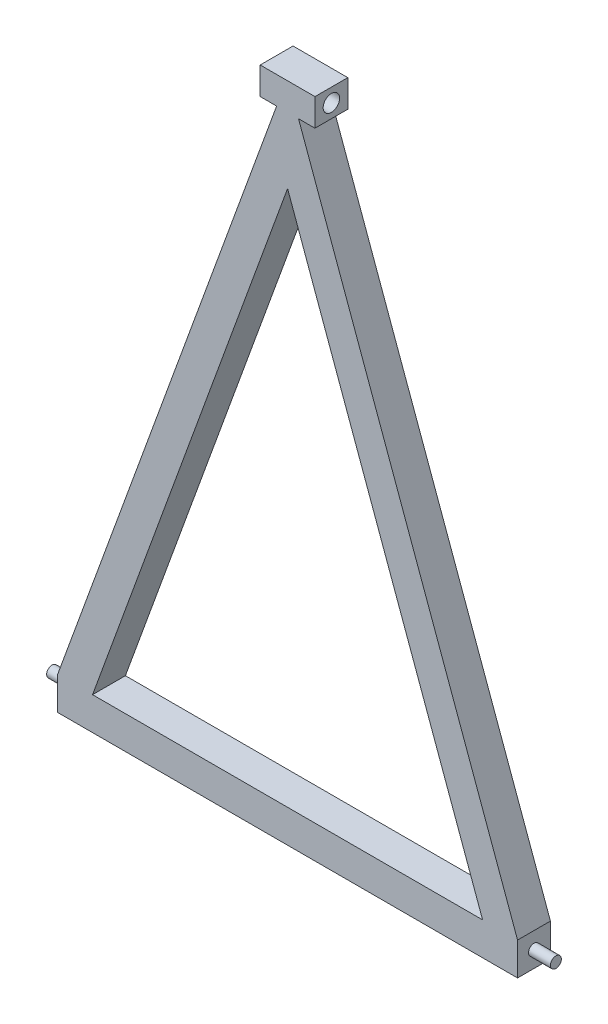
ISO-10303-21;
HEADER;
FILE_DESCRIPTION(('STEP AP214'),'2;1');
FILE_NAME('part.step','',(''),(''),'','','');
FILE_SCHEMA(('AUTOMOTIVE_DESIGN { 1 0 10303 214 1 1 1 1 }'));
ENDSEC;
DATA;
#1=APPLICATION_CONTEXT('core data for automotive mechanical design processes');
#2=APPLICATION_PROTOCOL_DEFINITION('international standard','automotive_design',2000,#1);
#3=PRODUCT_CONTEXT('',#1,'mechanical');
#4=PRODUCT('Part','Part','',(#3));
#5=PRODUCT_RELATED_PRODUCT_CATEGORY('part','',(#4));
#6=PRODUCT_DEFINITION_FORMATION('','',#4);
#7=PRODUCT_DEFINITION_CONTEXT('part definition',#1,'design');
#8=PRODUCT_DEFINITION('design','',#6,#7);
#9=PRODUCT_DEFINITION_SHAPE('','',#8);
#10=(LENGTH_UNIT() NAMED_UNIT(*) SI_UNIT(.MILLI.,.METRE.));
#11=(NAMED_UNIT(*) PLANE_ANGLE_UNIT() SI_UNIT($,.RADIAN.));
#12=(NAMED_UNIT(*) SI_UNIT($,.STERADIAN.) SOLID_ANGLE_UNIT());
#13=UNCERTAINTY_MEASURE_WITH_UNIT(LENGTH_MEASURE(1.E-05),#10,'distance_accuracy_value','');
#14=(GEOMETRIC_REPRESENTATION_CONTEXT(3) GLOBAL_UNCERTAINTY_ASSIGNED_CONTEXT((#13)) GLOBAL_UNIT_ASSIGNED_CONTEXT((#10,
#11,#12)) REPRESENTATION_CONTEXT('',''));
#15=CARTESIAN_POINT('',(0.,0.,0.));
#16=DIRECTION('',(0.,0.,1.));
#17=DIRECTION('',(1.,0.,0.));
#18=AXIS2_PLACEMENT_3D('',#15,#16,#17);
#19=CARTESIAN_POINT('',(0.,0.,76.2));
#20=DIRECTION('',(0.,0.,1.));
#21=DIRECTION('',(1.,0.,0.));
#22=AXIS2_PLACEMENT_3D('',#19,#20,#21);
#23=PLANE('',#22);
#24=DIRECTION('',(1.,0.,0.));
#25=VECTOR('',#24,1.);
#26=CARTESIAN_POINT('',(-533.4,0.,76.2));
#27=LINE('',#26,#25);
#28=CARTESIAN_POINT('',(-533.4,0.,76.2));
#29=VERTEX_POINT('',#28);
#30=CARTESIAN_POINT('',(533.4,0.,76.2));
#31=VERTEX_POINT('',#30);
#32=EDGE_CURVE('E156',#29,#31,#27,.T.);
#33=ORIENTED_EDGE('',*,*,#32,.T.);
#34=DIRECTION('',(0.,1.,0.));
#35=VECTOR('',#34,1.);
#36=CARTESIAN_POINT('',(533.4,0.,76.2));
#37=LINE('',#36,#35);
#38=CARTESIAN_POINT('',(533.4,76.2,76.2));
#39=VERTEX_POINT('',#38);
#40=EDGE_CURVE('E158',#31,#39,#37,.T.);
#41=ORIENTED_EDGE('',*,*,#40,.T.);
#42=DIRECTION('',(-0.342020143325666,0.939692620785909,0.));
#43=VECTOR('',#42,1.);
#44=CARTESIAN_POINT('',(533.4,76.2,76.2));
#45=LINE('',#44,#43);
#46=CARTESIAN_POINT('',(25.3999999999997,1471.91852908296,76.2));
#47=VERTEX_POINT('',#46);
#48=EDGE_CURVE('E161',#39,#47,#45,.T.);
#49=ORIENTED_EDGE('',*,*,#48,.T.);
#50=DIRECTION('',(1.,0.,0.));
#51=VECTOR('',#50,1.);
#52=CARTESIAN_POINT('',(25.3999999999997,1471.91852908296,76.2));
#53=LINE('',#52,#51);
#54=CARTESIAN_POINT('',(63.4999999999997,1471.91852908296,76.2));
#55=VERTEX_POINT('',#54);
#56=EDGE_CURVE('E163',#47,#55,#53,.T.);
#57=ORIENTED_EDGE('',*,*,#56,.T.);
#58=DIRECTION('',(0.,1.,0.));
#59=VECTOR('',#58,1.);
#60=CARTESIAN_POINT('',(63.4999999999997,1471.91852908296,76.2));
#61=LINE('',#60,#59);
#62=CARTESIAN_POINT('',(63.4999999999997,1535.41852908296,76.2));
#63=VERTEX_POINT('',#62);
#64=EDGE_CURVE('E165',#55,#63,#61,.T.);
#65=ORIENTED_EDGE('',*,*,#64,.T.);
#66=DIRECTION('',(-1.,0.,0.));
#67=VECTOR('',#66,1.);
#68=CARTESIAN_POINT('',(63.4999999999997,1535.41852908296,76.2));
#69=LINE('',#68,#67);
#70=CARTESIAN_POINT('',(-63.5000000000003,1535.41852908296,76.2));
#71=VERTEX_POINT('',#70);
#72=EDGE_CURVE('E167',#63,#71,#69,.T.);
#73=ORIENTED_EDGE('',*,*,#72,.T.);
#74=DIRECTION('',(0.,-1.,0.));
#75=VECTOR('',#74,1.);
#76=CARTESIAN_POINT('',(-63.5000000000003,1535.41852908296,76.2));
#77=LINE('',#76,#75);
#78=CARTESIAN_POINT('',(-63.5000000000003,1471.91852908296,76.2));
#79=VERTEX_POINT('',#78);
#80=EDGE_CURVE('E169',#71,#79,#77,.T.);
#81=ORIENTED_EDGE('',*,*,#80,.T.);
#82=DIRECTION('',(1.,0.,0.));
#83=VECTOR('',#82,1.);
#84=CARTESIAN_POINT('',(-63.5000000000003,1471.91852908296,76.2));
#85=LINE('',#84,#83);
#86=CARTESIAN_POINT('',(-25.4000000000003,1471.91852908296,76.2));
#87=VERTEX_POINT('',#86);
#88=EDGE_CURVE('E171',#79,#87,#85,.T.);
#89=ORIENTED_EDGE('',*,*,#88,.T.);
#90=DIRECTION('',(-0.342020143325666,-0.939692620785909,0.));
#91=VECTOR('',#90,1.);
#92=CARTESIAN_POINT('',(-25.4000000000003,1471.91852908296,76.2));
#93=LINE('',#92,#91);
#94=CARTESIAN_POINT('',(-533.4,76.2,76.2));
#95=VERTEX_POINT('',#94);
#96=EDGE_CURVE('E173',#87,#95,#93,.T.);
#97=ORIENTED_EDGE('',*,*,#96,.T.);
#98=DIRECTION('',(0.,-1.,0.));
#99=VECTOR('',#98,1.);
#100=CARTESIAN_POINT('',(-533.4,76.2,76.2));
#101=LINE('',#100,#99);
#102=EDGE_CURVE('E175',#95,#29,#101,.T.);
#103=ORIENTED_EDGE('',*,*,#102,.T.);
#104=EDGE_LOOP('',(#33,#41,#49,#57,#65,#73,#81,#89,#97,#103));
#105=FACE_BOUND('',#104,.T.);
#106=DIRECTION('',(1.,0.,0.));
#107=VECTOR('',#106,1.);
#108=CARTESIAN_POINT('',(-452.309653737336,76.2,76.2));
#109=LINE('',#108,#107);
#110=CARTESIAN_POINT('',(-452.309653737336,76.2,76.2));
#111=VERTEX_POINT('',#110);
#112=CARTESIAN_POINT('',(452.309653737336,76.2,76.2));
#113=VERTEX_POINT('',#112);
#114=EDGE_CURVE('E135',#111,#113,#109,.T.);
#115=ORIENTED_EDGE('',*,*,#114,.F.);
#116=DIRECTION('',(-0.342020143325666,-0.939692620785909,0.));
#117=VECTOR('',#116,1.);
#118=CARTESIAN_POINT('',(0.,1318.91056024468,76.2));
#119=LINE('',#118,#117);
#120=CARTESIAN_POINT('',(0.,1318.91056024468,76.2));
#121=VERTEX_POINT('',#120);
#122=EDGE_CURVE('E127',#121,#111,#119,.T.);
#123=ORIENTED_EDGE('',*,*,#122,.F.);
#124=DIRECTION('',(-0.342020143325666,0.939692620785909,0.));
#125=VECTOR('',#124,1.);
#126=CARTESIAN_POINT('',(452.309653737336,76.2,76.2));
#127=LINE('',#126,#125);
#128=EDGE_CURVE('E144',#113,#121,#127,.T.);
#129=ORIENTED_EDGE('',*,*,#128,.F.);
#130=EDGE_LOOP('',(#115,#123,#129));
#131=FACE_BOUND('',#130,.T.);
#132=ADVANCED_FACE('F32',(#105,#131),#23,.T.);
#133=CARTESIAN_POINT('',(0.,0.,0.));
#134=DIRECTION('',(0.,0.,1.));
#135=DIRECTION('',(1.,0.,0.));
#136=AXIS2_PLACEMENT_3D('',#133,#134,#135);
#137=PLANE('',#136);
#138=DIRECTION('',(1.,0.,0.));
#139=VECTOR('',#138,1.);
#140=CARTESIAN_POINT('',(0.,0.,0.));
#141=LINE('',#140,#139);
#142=CARTESIAN_POINT('',(-533.4,0.,0.));
#143=VERTEX_POINT('',#142);
#144=CARTESIAN_POINT('',(533.4,0.,0.));
#145=VERTEX_POINT('',#144);
#146=EDGE_CURVE('E142',#143,#145,#141,.T.);
#147=ORIENTED_EDGE('',*,*,#146,.F.);
#148=DIRECTION('',(0.,-1.,0.));
#149=VECTOR('',#148,1.);
#150=CARTESIAN_POINT('',(-533.4,76.2,0.));
#151=LINE('',#150,#149);
#152=CARTESIAN_POINT('',(-533.4,76.2,0.));
#153=VERTEX_POINT('',#152);
#154=EDGE_CURVE('E159',#153,#143,#151,.T.);
#155=ORIENTED_EDGE('',*,*,#154,.F.);
#156=DIRECTION('',(-0.342020143325666,-0.939692620785909,0.));
#157=VECTOR('',#156,1.);
#158=CARTESIAN_POINT('',(-25.4000000000003,1471.91852908296,0.));
#159=LINE('',#158,#157);
#160=CARTESIAN_POINT('',(-25.4000000000003,1471.91852908296,0.));
#161=VERTEX_POINT('',#160);
#162=EDGE_CURVE('E193',#161,#153,#159,.T.);
#163=ORIENTED_EDGE('',*,*,#162,.F.);
#164=DIRECTION('',(1.,0.,0.));
#165=VECTOR('',#164,1.);
#166=CARTESIAN_POINT('',(-63.5000000000003,1471.91852908296,0.));
#167=LINE('',#166,#165);
#168=CARTESIAN_POINT('',(-63.5000000000003,1471.91852908296,0.));
#169=VERTEX_POINT('',#168);
#170=EDGE_CURVE('E191',#169,#161,#167,.T.);
#171=ORIENTED_EDGE('',*,*,#170,.F.);
#172=DIRECTION('',(0.,-1.,0.));
#173=VECTOR('',#172,1.);
#174=CARTESIAN_POINT('',(-63.5000000000003,1535.41852908296,0.));
#175=LINE('',#174,#173);
#176=CARTESIAN_POINT('',(-63.5000000000003,1535.41852908296,0.));
#177=VERTEX_POINT('',#176);
#178=EDGE_CURVE('E189',#177,#169,#175,.T.);
#179=ORIENTED_EDGE('',*,*,#178,.F.);
#180=DIRECTION('',(-1.,0.,0.));
#181=VECTOR('',#180,1.);
#182=CARTESIAN_POINT('',(63.4999999999997,1535.41852908296,0.));
#183=LINE('',#182,#181);
#184=CARTESIAN_POINT('',(63.4999999999997,1535.41852908296,0.));
#185=VERTEX_POINT('',#184);
#186=EDGE_CURVE('E187',#185,#177,#183,.T.);
#187=ORIENTED_EDGE('',*,*,#186,.F.);
#188=DIRECTION('',(0.,1.,0.));
#189=VECTOR('',#188,1.);
#190=CARTESIAN_POINT('',(63.4999999999997,1471.91852908296,0.));
#191=LINE('',#190,#189);
#192=CARTESIAN_POINT('',(63.4999999999997,1471.91852908296,0.));
#193=VERTEX_POINT('',#192);
#194=EDGE_CURVE('E185',#193,#185,#191,.T.);
#195=ORIENTED_EDGE('',*,*,#194,.F.);
#196=DIRECTION('',(1.,0.,0.));
#197=VECTOR('',#196,1.);
#198=CARTESIAN_POINT('',(25.3999999999997,1471.91852908296,0.));
#199=LINE('',#198,#197);
#200=CARTESIAN_POINT('',(25.3999999999997,1471.91852908296,0.));
#201=VERTEX_POINT('',#200);
#202=EDGE_CURVE('E183',#201,#193,#199,.T.);
#203=ORIENTED_EDGE('',*,*,#202,.F.);
#204=DIRECTION('',(-0.342020143325666,0.939692620785909,0.));
#205=VECTOR('',#204,1.);
#206=CARTESIAN_POINT('',(533.4,76.2,0.));
#207=LINE('',#206,#205);
#208=CARTESIAN_POINT('',(533.4,76.2,0.));
#209=VERTEX_POINT('',#208);
#210=EDGE_CURVE('E181',#209,#201,#207,.T.);
#211=ORIENTED_EDGE('',*,*,#210,.F.);
#212=DIRECTION('',(0.,1.,0.));
#213=VECTOR('',#212,1.);
#214=CARTESIAN_POINT('',(533.4,0.,0.));
#215=LINE('',#214,#213);
#216=EDGE_CURVE('E179',#145,#209,#215,.T.);
#217=ORIENTED_EDGE('',*,*,#216,.F.);
#218=EDGE_LOOP('',(#147,#155,#163,#171,#179,#187,#195,#203,#211,#217));
#219=FACE_BOUND('',#218,.T.);
#220=DIRECTION('',(-0.342020143325666,-0.939692620785909,0.));
#221=VECTOR('',#220,1.);
#222=CARTESIAN_POINT('',(0.,1318.91056024468,0.));
#223=LINE('',#222,#221);
#224=CARTESIAN_POINT('',(1.66533453693773E-13,1318.91056024468,0.));
#225=VERTEX_POINT('',#224);
#226=CARTESIAN_POINT('',(-452.309653737336,76.2,0.));
#227=VERTEX_POINT('',#226);
#228=EDGE_CURVE('E55',#225,#227,#223,.T.);
#229=ORIENTED_EDGE('',*,*,#228,.T.);
#230=DIRECTION('',(1.,0.,0.));
#231=VECTOR('',#230,1.);
#232=CARTESIAN_POINT('',(-452.309653737336,76.2,0.));
#233=LINE('',#232,#231);
#234=CARTESIAN_POINT('',(452.309653737336,76.2,0.));
#235=VERTEX_POINT('',#234);
#236=EDGE_CURVE('E141',#227,#235,#233,.T.);
#237=ORIENTED_EDGE('',*,*,#236,.T.);
#238=DIRECTION('',(-0.342020143325666,0.939692620785909,0.));
#239=VECTOR('',#238,1.);
#240=CARTESIAN_POINT('',(452.309653737336,76.2,0.));
#241=LINE('',#240,#239);
#242=EDGE_CURVE('E136',#235,#225,#241,.T.);
#243=ORIENTED_EDGE('',*,*,#242,.T.);
#244=EDGE_LOOP('',(#229,#237,#243));
#245=FACE_BOUND('',#244,.T.);
#246=ADVANCED_FACE('F255',(#219,#245),#137,.F.);
#247=CARTESIAN_POINT('',(0.,0.,76.2));
#248=DIRECTION('',(0.,1.,0.));
#249=DIRECTION('',(0.,0.,1.));
#250=AXIS2_PLACEMENT_3D('',#247,#248,#249);
#251=PLANE('',#250);
#252=ORIENTED_EDGE('',*,*,#146,.T.);
#253=DIRECTION('',(0.,0.,-1.));
#254=VECTOR('',#253,1.);
#255=CARTESIAN_POINT('',(533.4,0.,76.2));
#256=LINE('',#255,#254);
#257=EDGE_CURVE('E223',#31,#145,#256,.T.);
#258=ORIENTED_EDGE('',*,*,#257,.F.);
#259=ORIENTED_EDGE('',*,*,#32,.F.);
#260=DIRECTION('',(0.,0.,-1.));
#261=VECTOR('',#260,1.);
#262=CARTESIAN_POINT('',(-533.4,0.,76.2));
#263=LINE('',#262,#261);
#264=EDGE_CURVE('E177',#29,#143,#263,.T.);
#265=ORIENTED_EDGE('',*,*,#264,.T.);
#266=EDGE_LOOP('',(#252,#258,#259,#265));
#267=FACE_BOUND('',#266,.T.);
#268=ADVANCED_FACE('F34',(#267),#251,.F.);
#269=CARTESIAN_POINT('',(533.4,0.,76.2));
#270=DIRECTION('',(-1.,0.,0.));
#271=DIRECTION('',(0.,0.,1.));
#272=AXIS2_PLACEMENT_3D('',#269,#270,#271);
#273=PLANE('',#272);
#274=CARTESIAN_POINT('',(533.4,38.1,38.1));
#275=DIRECTION('',(-1.,0.,0.));
#276=DIRECTION('',(0.,0.,1.));
#277=AXIS2_PLACEMENT_3D('',#274,#275,#276);
#278=CIRCLE('',#277,12.7);
#279=CARTESIAN_POINT('',(533.4,38.1,50.8));
#280=VERTEX_POINT('',#279);
#281=EDGE_CURVE('E11',#280,#280,#278,.F.);
#282=ORIENTED_EDGE('',*,*,#281,.F.);
#283=EDGE_LOOP('',(#282));
#284=FACE_BOUND('',#283,.T.);
#285=ORIENTED_EDGE('',*,*,#216,.T.);
#286=DIRECTION('',(0.,0.,-1.));
#287=VECTOR('',#286,1.);
#288=CARTESIAN_POINT('',(533.4,76.2,76.2));
#289=LINE('',#288,#287);
#290=EDGE_CURVE('E220',#39,#209,#289,.T.);
#291=ORIENTED_EDGE('',*,*,#290,.F.);
#292=ORIENTED_EDGE('',*,*,#40,.F.);
#293=ORIENTED_EDGE('',*,*,#257,.T.);
#294=EDGE_LOOP('',(#285,#291,#292,#293));
#295=FACE_BOUND('',#294,.T.);
#296=ADVANCED_FACE('F286',(#284,#295),#273,.F.);
#297=CARTESIAN_POINT('',(533.4,76.2,76.2));
#298=DIRECTION('',(-0.939692620785909,-0.342020143325666,0.));
#299=DIRECTION('',(0.342020143325666,-0.939692620785909,0.));
#300=AXIS2_PLACEMENT_3D('',#297,#298,#299);
#301=PLANE('',#300);
#302=ORIENTED_EDGE('',*,*,#210,.T.);
#303=DIRECTION('',(0.,0.,-1.));
#304=VECTOR('',#303,1.);
#305=CARTESIAN_POINT('',(25.3999999999997,1471.91852908296,76.2));
#306=LINE('',#305,#304);
#307=EDGE_CURVE('E217',#47,#201,#306,.T.);
#308=ORIENTED_EDGE('',*,*,#307,.F.);
#309=ORIENTED_EDGE('',*,*,#48,.F.);
#310=ORIENTED_EDGE('',*,*,#290,.T.);
#311=EDGE_LOOP('',(#302,#308,#309,#310));
#312=FACE_BOUND('',#311,.T.);
#313=ADVANCED_FACE('F283',(#312),#301,.F.);
#314=CARTESIAN_POINT('',(25.3999999999997,1471.91852908296,76.2));
#315=DIRECTION('',(0.,1.,0.));
#316=DIRECTION('',(-1.,0.,0.));
#317=AXIS2_PLACEMENT_3D('',#314,#315,#316);
#318=PLANE('',#317);
#319=ORIENTED_EDGE('',*,*,#202,.T.);
#320=DIRECTION('',(0.,0.,-1.));
#321=VECTOR('',#320,1.);
#322=CARTESIAN_POINT('',(63.4999999999997,1471.91852908296,76.2));
#323=LINE('',#322,#321);
#324=EDGE_CURVE('E214',#55,#193,#323,.T.);
#325=ORIENTED_EDGE('',*,*,#324,.F.);
#326=ORIENTED_EDGE('',*,*,#56,.F.);
#327=ORIENTED_EDGE('',*,*,#307,.T.);
#328=EDGE_LOOP('',(#319,#325,#326,#327));
#329=FACE_BOUND('',#328,.T.);
#330=ADVANCED_FACE('F279',(#329),#318,.F.);
#331=CARTESIAN_POINT('',(63.4999999999997,1471.91852908296,76.2));
#332=DIRECTION('',(-1.,0.,0.));
#333=DIRECTION('',(0.,0.,1.));
#334=AXIS2_PLACEMENT_3D('',#331,#332,#333);
#335=PLANE('',#334);
#336=CARTESIAN_POINT('',(63.4999999999997,1503.66852908296,38.1));
#337=DIRECTION('',(1.,0.,0.));
#338=DIRECTION('',(0.,0.,-1.));
#339=AXIS2_PLACEMENT_3D('',#336,#337,#338);
#340=CIRCLE('',#339,19.05);
#341=CARTESIAN_POINT('',(63.4999999999997,1503.66852908296,19.05));
#342=VERTEX_POINT('',#341);
#343=EDGE_CURVE('E227',#342,#342,#340,.T.);
#344=ORIENTED_EDGE('',*,*,#343,.F.);
#345=EDGE_LOOP('',(#344));
#346=FACE_BOUND('',#345,.T.);
#347=ORIENTED_EDGE('',*,*,#194,.T.);
#348=DIRECTION('',(0.,0.,-1.));
#349=VECTOR('',#348,1.);
#350=CARTESIAN_POINT('',(63.4999999999997,1535.41852908296,76.2));
#351=LINE('',#350,#349);
#352=EDGE_CURVE('E211',#63,#185,#351,.T.);
#353=ORIENTED_EDGE('',*,*,#352,.F.);
#354=ORIENTED_EDGE('',*,*,#64,.F.);
#355=ORIENTED_EDGE('',*,*,#324,.T.);
#356=EDGE_LOOP('',(#347,#353,#354,#355));
#357=FACE_BOUND('',#356,.T.);
#358=ADVANCED_FACE('F274',(#346,#357),#335,.F.);
#359=CARTESIAN_POINT('',(63.4999999999997,1535.41852908296,76.2));
#360=DIRECTION('',(0.,-1.,0.));
#361=DIRECTION('',(0.,0.,-1.));
#362=AXIS2_PLACEMENT_3D('',#359,#360,#361);
#363=PLANE('',#362);
#364=ORIENTED_EDGE('',*,*,#186,.T.);
#365=DIRECTION('',(0.,0.,-1.));
#366=VECTOR('',#365,1.);
#367=CARTESIAN_POINT('',(-63.5000000000003,1535.41852908296,76.2));
#368=LINE('',#367,#366);
#369=EDGE_CURVE('E208',#71,#177,#368,.T.);
#370=ORIENTED_EDGE('',*,*,#369,.F.);
#371=ORIENTED_EDGE('',*,*,#72,.F.);
#372=ORIENTED_EDGE('',*,*,#352,.T.);
#373=EDGE_LOOP('',(#364,#370,#371,#372));
#374=FACE_BOUND('',#373,.T.);
#375=ADVANCED_FACE('F268',(#374),#363,.F.);
#376=CARTESIAN_POINT('',(-63.5000000000003,1535.41852908296,76.2));
#377=DIRECTION('',(1.,0.,0.));
#378=DIRECTION('',(0.,1.,0.));
#379=AXIS2_PLACEMENT_3D('',#376,#377,#378);
#380=PLANE('',#379);
#381=CARTESIAN_POINT('',(-63.5000000000003,1503.66852908296,38.1));
#382=DIRECTION('',(1.,0.,0.));
#383=DIRECTION('',(0.,1.,0.));
#384=AXIS2_PLACEMENT_3D('',#381,#382,#383);
#385=CIRCLE('',#384,19.05);
#386=CARTESIAN_POINT('',(-63.5000000000003,1522.71852908296,38.1));
#387=VERTEX_POINT('',#386);
#388=EDGE_CURVE('E150',#387,#387,#385,.T.);
#389=ORIENTED_EDGE('',*,*,#388,.T.);
#390=EDGE_LOOP('',(#389));
#391=FACE_BOUND('',#390,.T.);
#392=ORIENTED_EDGE('',*,*,#178,.T.);
#393=DIRECTION('',(0.,0.,-1.));
#394=VECTOR('',#393,1.);
#395=CARTESIAN_POINT('',(-63.5000000000003,1471.91852908296,76.2));
#396=LINE('',#395,#394);
#397=EDGE_CURVE('E205',#79,#169,#396,.T.);
#398=ORIENTED_EDGE('',*,*,#397,.F.);
#399=ORIENTED_EDGE('',*,*,#80,.F.);
#400=ORIENTED_EDGE('',*,*,#369,.T.);
#401=EDGE_LOOP('',(#392,#398,#399,#400));
#402=FACE_BOUND('',#401,.T.);
#403=ADVANCED_FACE('F264',(#391,#402),#380,.F.);
#404=CARTESIAN_POINT('',(-63.5000000000003,1471.91852908296,76.2));
#405=DIRECTION('',(0.,1.,0.));
#406=DIRECTION('',(-1.,0.,0.));
#407=AXIS2_PLACEMENT_3D('',#404,#405,#406);
#408=PLANE('',#407);
#409=ORIENTED_EDGE('',*,*,#170,.T.);
#410=DIRECTION('',(0.,0.,-1.));
#411=VECTOR('',#410,1.);
#412=CARTESIAN_POINT('',(-25.4000000000003,1471.91852908296,76.2));
#413=LINE('',#412,#411);
#414=EDGE_CURVE('E202',#87,#161,#413,.T.);
#415=ORIENTED_EDGE('',*,*,#414,.F.);
#416=ORIENTED_EDGE('',*,*,#88,.F.);
#417=ORIENTED_EDGE('',*,*,#397,.T.);
#418=EDGE_LOOP('',(#409,#415,#416,#417));
#419=FACE_BOUND('',#418,.T.);
#420=ADVANCED_FACE('F260',(#419),#408,.F.);
#421=CARTESIAN_POINT('',(-25.4000000000003,1471.91852908296,76.2));
#422=DIRECTION('',(0.939692620785909,-0.342020143325666,0.));
#423=DIRECTION('',(0.342020143325666,0.939692620785909,0.));
#424=AXIS2_PLACEMENT_3D('',#421,#422,#423);
#425=PLANE('',#424);
#426=ORIENTED_EDGE('',*,*,#162,.T.);
#427=DIRECTION('',(0.,0.,-1.));
#428=VECTOR('',#427,1.);
#429=CARTESIAN_POINT('',(-533.4,76.2,76.2));
#430=LINE('',#429,#428);
#431=EDGE_CURVE('E199',#95,#153,#430,.T.);
#432=ORIENTED_EDGE('',*,*,#431,.F.);
#433=ORIENTED_EDGE('',*,*,#96,.F.);
#434=ORIENTED_EDGE('',*,*,#414,.T.);
#435=EDGE_LOOP('',(#426,#432,#433,#434));
#436=FACE_BOUND('',#435,.T.);
#437=ADVANCED_FACE('F236',(#436),#425,.F.);
#438=CARTESIAN_POINT('',(-533.4,76.2,76.2));
#439=DIRECTION('',(1.,0.,0.));
#440=DIRECTION('',(0.,0.,-1.));
#441=AXIS2_PLACEMENT_3D('',#438,#439,#440);
#442=PLANE('',#441);
#443=CARTESIAN_POINT('',(-533.4,38.1,38.1));
#444=DIRECTION('',(1.,0.,0.));
#445=DIRECTION('',(0.,0.,-1.));
#446=AXIS2_PLACEMENT_3D('',#443,#444,#445);
#447=CIRCLE('',#446,12.7);
#448=CARTESIAN_POINT('',(-533.4,38.1,25.4));
#449=VERTEX_POINT('',#448);
#450=EDGE_CURVE('E40',#449,#449,#447,.F.);
#451=ORIENTED_EDGE('',*,*,#450,.F.);
#452=EDGE_LOOP('',(#451));
#453=FACE_BOUND('',#452,.T.);
#454=ORIENTED_EDGE('',*,*,#154,.T.);
#455=ORIENTED_EDGE('',*,*,#264,.F.);
#456=ORIENTED_EDGE('',*,*,#102,.F.);
#457=ORIENTED_EDGE('',*,*,#431,.T.);
#458=EDGE_LOOP('',(#454,#455,#456,#457));
#459=FACE_BOUND('',#458,.T.);
#460=ADVANCED_FACE('F233',(#453,#459),#442,.F.);
#461=CARTESIAN_POINT('',(0.,1318.91056024468,76.2));
#462=DIRECTION('',(0.939692620785909,-0.342020143325666,0.));
#463=DIRECTION('',(0.342020143325666,0.93969262078591,0.));
#464=AXIS2_PLACEMENT_3D('',#461,#462,#463);
#465=PLANE('',#464);
#466=ORIENTED_EDGE('',*,*,#228,.F.);
#467=DIRECTION('',(0.,0.,-1.));
#468=VECTOR('',#467,1.);
#469=CARTESIAN_POINT('',(0.,1318.91056024468,76.2));
#470=LINE('',#469,#468);
#471=EDGE_CURVE('E131',#121,#225,#470,.T.);
#472=ORIENTED_EDGE('',*,*,#471,.F.);
#473=ORIENTED_EDGE('',*,*,#122,.T.);
#474=DIRECTION('',(0.,0.,-1.));
#475=VECTOR('',#474,1.);
#476=CARTESIAN_POINT('',(-452.309653737336,76.2,76.2));
#477=LINE('',#476,#475);
#478=EDGE_CURVE('E130',#111,#227,#477,.T.);
#479=ORIENTED_EDGE('',*,*,#478,.T.);
#480=EDGE_LOOP('',(#466,#472,#473,#479));
#481=FACE_BOUND('',#480,.T.);
#482=ADVANCED_FACE('F129',(#481),#465,.T.);
#483=CARTESIAN_POINT('',(-452.309653737336,76.2,76.2));
#484=DIRECTION('',(0.,1.,0.));
#485=DIRECTION('',(0.,0.,1.));
#486=AXIS2_PLACEMENT_3D('',#483,#484,#485);
#487=PLANE('',#486);
#488=ORIENTED_EDGE('',*,*,#236,.F.);
#489=ORIENTED_EDGE('',*,*,#478,.F.);
#490=ORIENTED_EDGE('',*,*,#114,.T.);
#491=DIRECTION('',(0.,0.,-1.));
#492=VECTOR('',#491,1.);
#493=CARTESIAN_POINT('',(452.309653737336,76.2,76.2));
#494=LINE('',#493,#492);
#495=EDGE_CURVE('E47',#113,#235,#494,.T.);
#496=ORIENTED_EDGE('',*,*,#495,.T.);
#497=EDGE_LOOP('',(#488,#489,#490,#496));
#498=FACE_BOUND('',#497,.T.);
#499=ADVANCED_FACE('F139',(#498),#487,.T.);
#500=CARTESIAN_POINT('',(452.309653737336,76.2,76.2));
#501=DIRECTION('',(-0.939692620785909,-0.342020143325666,0.));
#502=DIRECTION('',(0.342020143325666,-0.939692620785909,0.));
#503=AXIS2_PLACEMENT_3D('',#500,#501,#502);
#504=PLANE('',#503);
#505=ORIENTED_EDGE('',*,*,#242,.F.);
#506=ORIENTED_EDGE('',*,*,#495,.F.);
#507=ORIENTED_EDGE('',*,*,#128,.T.);
#508=ORIENTED_EDGE('',*,*,#471,.T.);
#509=EDGE_LOOP('',(#505,#506,#507,#508));
#510=FACE_BOUND('',#509,.T.);
#511=ADVANCED_FACE('F359',(#510),#504,.T.);
#512=CARTESIAN_POINT('',(-77.4700000000004,1503.66852908296,38.1));
#513=DIRECTION('',(1.,0.,0.));
#514=DIRECTION('',(0.,0.,-1.));
#515=AXIS2_PLACEMENT_3D('',#512,#513,#514);
#516=CYLINDRICAL_SURFACE('',#515,19.05);
#517=ORIENTED_EDGE('',*,*,#343,.T.);
#518=EDGE_LOOP('',(#517));
#519=FACE_BOUND('',#518,.T.);
#520=ORIENTED_EDGE('',*,*,#388,.F.);
#521=EDGE_LOOP('',(#520));
#522=FACE_BOUND('',#521,.T.);
#523=ADVANCED_FACE('F364',(#519,#522),#516,.F.);
#524=CARTESIAN_POINT('',(-584.2,38.1,38.1));
#525=DIRECTION('',(1.,0.,0.));
#526=DIRECTION('',(0.,0.,-1.));
#527=AXIS2_PLACEMENT_3D('',#524,#525,#526);
#528=CYLINDRICAL_SURFACE('',#527,12.7);
#529=CARTESIAN_POINT('',(-584.2,38.1,38.1));
#530=DIRECTION('',(-1.,0.,0.));
#531=DIRECTION('',(0.,0.,1.));
#532=AXIS2_PLACEMENT_3D('',#529,#530,#531);
#533=CIRCLE('',#532,12.7);
#534=CARTESIAN_POINT('',(-584.2,38.1,50.8));
#535=VERTEX_POINT('',#534);
#536=EDGE_CURVE('E463',#535,#535,#533,.T.);
#537=ORIENTED_EDGE('',*,*,#536,.F.);
#538=EDGE_LOOP('',(#537));
#539=FACE_BOUND('',#538,.T.);
#540=ORIENTED_EDGE('',*,*,#450,.T.);
#541=EDGE_LOOP('',(#540));
#542=FACE_BOUND('',#541,.T.);
#543=ADVANCED_FACE('F231',(#539,#542),#528,.T.);
#544=CARTESIAN_POINT('',(-584.2,38.1,38.1));
#545=DIRECTION('',(-1.,0.,0.));
#546=DIRECTION('',(0.,0.,1.));
#547=AXIS2_PLACEMENT_3D('',#544,#545,#546);
#548=PLANE('',#547);
#549=ORIENTED_EDGE('',*,*,#536,.T.);
#550=EDGE_LOOP('',(#549));
#551=FACE_BOUND('',#550,.T.);
#552=ADVANCED_FACE('F376',(#551),#548,.T.);
#553=CARTESIAN_POINT('',(584.2,38.1,38.1));
#554=DIRECTION('',(-1.,0.,0.));
#555=DIRECTION('',(0.,0.,1.));
#556=AXIS2_PLACEMENT_3D('',#553,#554,#555);
#557=CYLINDRICAL_SURFACE('',#556,12.7);
#558=CARTESIAN_POINT('',(584.2,38.1,38.1));
#559=DIRECTION('',(1.,0.,0.));
#560=DIRECTION('',(0.,0.,-1.));
#561=AXIS2_PLACEMENT_3D('',#558,#559,#560);
#562=CIRCLE('',#561,12.7);
#563=CARTESIAN_POINT('',(584.2,38.1,25.4));
#564=VERTEX_POINT('',#563);
#565=EDGE_CURVE('E462',#564,#564,#562,.T.);
#566=ORIENTED_EDGE('',*,*,#565,.F.);
#567=EDGE_LOOP('',(#566));
#568=FACE_BOUND('',#567,.T.);
#569=ORIENTED_EDGE('',*,*,#281,.T.);
#570=EDGE_LOOP('',(#569));
#571=FACE_BOUND('',#570,.T.);
#572=ADVANCED_FACE('F384',(#568,#571),#557,.T.);
#573=CARTESIAN_POINT('',(584.2,38.1,38.1));
#574=DIRECTION('',(1.,0.,0.));
#575=DIRECTION('',(0.,0.,-1.));
#576=AXIS2_PLACEMENT_3D('',#573,#574,#575);
#577=PLANE('',#576);
#578=ORIENTED_EDGE('',*,*,#565,.T.);
#579=EDGE_LOOP('',(#578));
#580=FACE_BOUND('',#579,.T.);
#581=ADVANCED_FACE('F392',(#580),#577,.T.);
#582=CLOSED_SHELL('',(#132,#246,#268,#296,#313,#330,#358,#375,#403,#420,#437,#460,#482,#499,
#511,#523,#543,#552,#572,#581));
#583=MANIFOLD_SOLID_BREP('B2',#582);
#584=ADVANCED_BREP_SHAPE_REPRESENTATION('',(#18,#583),#14);
#585=SHAPE_DEFINITION_REPRESENTATION(#9,#584);
ENDSEC;
END-ISO-10303-21;
